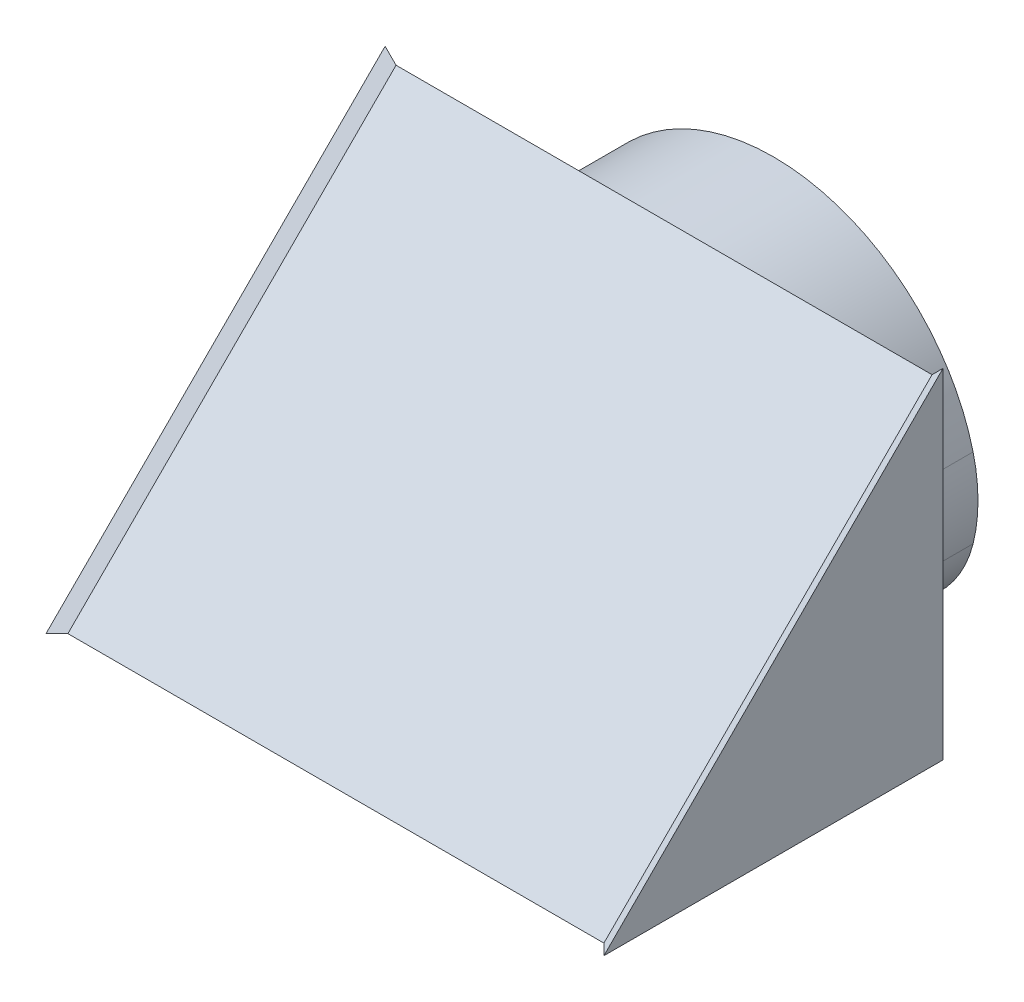
ISO-10303-21;
HEADER;
FILE_DESCRIPTION(('STEP AP214'),'2;1');
FILE_NAME('part.step','',(''),(''),'','','');
FILE_SCHEMA(('AUTOMOTIVE_DESIGN { 1 0 10303 214 1 1 1 1 }'));
ENDSEC;
DATA;
#1=APPLICATION_CONTEXT('core data for automotive mechanical design processes');
#2=APPLICATION_PROTOCOL_DEFINITION('international standard','automotive_design',2000,#1);
#3=PRODUCT_CONTEXT('',#1,'mechanical');
#4=PRODUCT('Part','Part','',(#3));
#5=PRODUCT_RELATED_PRODUCT_CATEGORY('part','',(#4));
#6=PRODUCT_DEFINITION_FORMATION('','',#4);
#7=PRODUCT_DEFINITION_CONTEXT('part definition',#1,'design');
#8=PRODUCT_DEFINITION('design','',#6,#7);
#9=PRODUCT_DEFINITION_SHAPE('','',#8);
#10=(LENGTH_UNIT() NAMED_UNIT(*) SI_UNIT(.MILLI.,.METRE.));
#11=(NAMED_UNIT(*) PLANE_ANGLE_UNIT() SI_UNIT($,.RADIAN.));
#12=(NAMED_UNIT(*) SI_UNIT($,.STERADIAN.) SOLID_ANGLE_UNIT());
#13=UNCERTAINTY_MEASURE_WITH_UNIT(LENGTH_MEASURE(1.E-05),#10,'distance_accuracy_value','');
#14=(GEOMETRIC_REPRESENTATION_CONTEXT(3) GLOBAL_UNCERTAINTY_ASSIGNED_CONTEXT((#13)) GLOBAL_UNIT_ASSIGNED_CONTEXT((#10,
#11,#12)) REPRESENTATION_CONTEXT('',''));
#15=CARTESIAN_POINT('',(0.,0.,0.));
#16=DIRECTION('',(0.,0.,1.));
#17=DIRECTION('',(1.,0.,0.));
#18=AXIS2_PLACEMENT_3D('',#15,#16,#17);
#19=CARTESIAN_POINT('',(10.2,12.,0.));
#20=DIRECTION('',(0.,0.,1.));
#21=DIRECTION('',(0.,-1.,0.));
#22=AXIS2_PLACEMENT_3D('',#19,#20,#21);
#23=PLANE('',#22);
#24=CARTESIAN_POINT('',(2.94796327024208,4.48690621016901,0.));
#25=DIRECTION('',(0.,0.,-1.));
#26=DIRECTION('',(0.,-1.,0.));
#27=AXIS2_PLACEMENT_3D('',#24,#25,#26);
#28=CIRCLE('',#27,4.48690621016901);
#29=CARTESIAN_POINT('',(7.30012051014887,3.39555168574525,0.));
#30=VERTEX_POINT('',#29);
#31=CARTESIAN_POINT('',(2.94796327024208,0.,0.));
#32=VERTEX_POINT('',#31);
#33=EDGE_CURVE('E61',#30,#32,#28,.T.);
#34=ORIENTED_EDGE('',*,*,#33,.F.);
#35=CARTESIAN_POINT('',(1.5,4.85,0.));
#36=DIRECTION('',(0.,0.,-1.));
#37=DIRECTION('',(0.,-1.,0.));
#38=AXIS2_PLACEMENT_3D('',#35,#36,#37);
#39=CIRCLE('',#38,5.97970048004815);
#40=CARTESIAN_POINT('',(7.30012051014887,6.30444831425474,0.));
#41=VERTEX_POINT('',#40);
#42=EDGE_CURVE('E65',#41,#30,#39,.T.);
#43=ORIENTED_EDGE('',*,*,#42,.F.);
#44=CARTESIAN_POINT('',(0.,4.47385738924481,0.));
#45=DIRECTION('',(0.,0.,-1.));
#46=DIRECTION('',(0.,-1.,0.));
#47=AXIS2_PLACEMENT_3D('',#44,#45,#46);
#48=CIRCLE('',#47,7.52614261075519);
#49=CARTESIAN_POINT('',(0.,12.,0.));
#50=VERTEX_POINT('',#49);
#51=EDGE_CURVE('E11',#50,#41,#48,.T.);
#52=ORIENTED_EDGE('',*,*,#51,.F.);
#53=DIRECTION('',(-1.,0.,0.));
#54=VECTOR('',#53,1.);
#55=CARTESIAN_POINT('',(10.2,12.,0.));
#56=LINE('',#55,#54);
#57=CARTESIAN_POINT('',(9.8,12.,0.));
#58=VERTEX_POINT('',#57);
#59=EDGE_CURVE('E47',#58,#50,#56,.T.);
#60=ORIENTED_EDGE('',*,*,#59,.F.);
#61=DIRECTION('',(0.707106781186547,0.707106781186547,0.));
#62=VECTOR('',#61,1.);
#63=CARTESIAN_POINT('',(9.8,12.,0.));
#64=LINE('',#63,#62);
#65=CARTESIAN_POINT('',(10.2,12.4,0.));
#66=VERTEX_POINT('',#65);
#67=EDGE_CURVE('E226',#58,#66,#64,.T.);
#68=ORIENTED_EDGE('',*,*,#67,.T.);
#69=DIRECTION('',(0.,1.,0.));
#70=VECTOR('',#69,1.);
#71=CARTESIAN_POINT('',(10.2,12.,0.));
#72=LINE('',#71,#70);
#73=CARTESIAN_POINT('',(10.2,0.,0.));
#74=VERTEX_POINT('',#73);
#75=EDGE_CURVE('E245',#74,#66,#72,.T.);
#76=ORIENTED_EDGE('',*,*,#75,.F.);
#77=DIRECTION('',(-1.,0.,0.));
#78=VECTOR('',#77,1.);
#79=CARTESIAN_POINT('',(10.2,0.,0.));
#80=LINE('',#79,#78);
#81=EDGE_CURVE('E258',#74,#32,#80,.T.);
#82=ORIENTED_EDGE('',*,*,#81,.T.);
#83=EDGE_LOOP('',(#34,#43,#52,#60,#68,#76,#82));
#84=FACE_BOUND('',#83,.T.);
#85=ADVANCED_FACE('F43',(#84),#23,.F.);
#86=CARTESIAN_POINT('',(-7.30012051014888,6.30444831425475,0.));
#87=VERTEX_POINT('',#86);
#88=EDGE_CURVE('E54',#87,#50,#48,.T.);
#89=ORIENTED_EDGE('',*,*,#88,.F.);
#90=CARTESIAN_POINT('',(-1.5,4.85,0.));
#91=DIRECTION('',(0.,0.,-1.));
#92=DIRECTION('',(0.,-1.,0.));
#93=AXIS2_PLACEMENT_3D('',#90,#91,#92);
#94=CIRCLE('',#93,5.97970048004816);
#95=CARTESIAN_POINT('',(-7.30012051014887,3.39555168574523,0.));
#96=VERTEX_POINT('',#95);
#97=EDGE_CURVE('E287',#96,#87,#94,.T.);
#98=ORIENTED_EDGE('',*,*,#97,.F.);
#99=CARTESIAN_POINT('',(-2.94796327024208,4.48690621016901,0.));
#100=DIRECTION('',(0.,0.,-1.));
#101=DIRECTION('',(0.,1.,0.));
#102=AXIS2_PLACEMENT_3D('',#99,#100,#101);
#103=CIRCLE('',#102,4.48690621016902);
#104=CARTESIAN_POINT('',(-2.94796327024208,0.,0.));
#105=VERTEX_POINT('',#104);
#106=EDGE_CURVE('E291',#105,#96,#103,.T.);
#107=ORIENTED_EDGE('',*,*,#106,.F.);
#108=CARTESIAN_POINT('',(-10.2,0.,0.));
#109=VERTEX_POINT('',#108);
#110=EDGE_CURVE('E252',#105,#109,#80,.T.);
#111=ORIENTED_EDGE('',*,*,#110,.T.);
#112=DIRECTION('',(0.,1.,0.));
#113=VECTOR('',#112,1.);
#114=CARTESIAN_POINT('',(-10.2,12.,0.));
#115=LINE('',#114,#113);
#116=CARTESIAN_POINT('',(-10.2,12.4,0.));
#117=VERTEX_POINT('',#116);
#118=EDGE_CURVE('E233',#109,#117,#115,.T.);
#119=ORIENTED_EDGE('',*,*,#118,.T.);
#120=DIRECTION('',(0.707106781186547,-0.707106781186547,0.));
#121=VECTOR('',#120,1.);
#122=CARTESIAN_POINT('',(-10.2,12.4,0.));
#123=LINE('',#122,#121);
#124=CARTESIAN_POINT('',(-9.8,12.,0.));
#125=VERTEX_POINT('',#124);
#126=EDGE_CURVE('E218',#117,#125,#123,.T.);
#127=ORIENTED_EDGE('',*,*,#126,.T.);
#128=EDGE_CURVE('E263',#50,#125,#56,.T.);
#129=ORIENTED_EDGE('',*,*,#128,.F.);
#130=EDGE_LOOP('',(#89,#98,#107,#111,#119,#127,#129));
#131=FACE_BOUND('',#130,.T.);
#132=ADVANCED_FACE('F45',(#131),#23,.F.);
#133=CARTESIAN_POINT('',(10.2,0.,12.0000000000001));
#134=DIRECTION('',(0.,-0.707106781186551,-0.707106781186544));
#135=DIRECTION('',(0.,0.707106781186544,-0.707106781186551));
#136=AXIS2_PLACEMENT_3D('',#133,#134,#135);
#137=PLANE('',#136);
#138=ORIENTED_EDGE('',*,*,#59,.T.);
#139=ORIENTED_EDGE('',*,*,#128,.T.);
#140=DIRECTION('',(0.,0.707106781186544,-0.707106781186551));
#141=VECTOR('',#140,1.);
#142=CARTESIAN_POINT('',(-9.8,-0.68284271247462,12.6828427124747));
#143=LINE('',#142,#141);
#144=CARTESIAN_POINT('',(-9.8,0.,12.0000000000001));
#145=VERTEX_POINT('',#144);
#146=EDGE_CURVE('E219',#145,#125,#143,.T.);
#147=ORIENTED_EDGE('',*,*,#146,.F.);
#148=DIRECTION('',(-1.,0.,0.));
#149=VECTOR('',#148,1.);
#150=CARTESIAN_POINT('',(10.2,0.,12.0000000000001));
#151=LINE('',#150,#149);
#152=CARTESIAN_POINT('',(9.8,0.,12.0000000000001));
#153=VERTEX_POINT('',#152);
#154=EDGE_CURVE('E260',#153,#145,#151,.T.);
#155=ORIENTED_EDGE('',*,*,#154,.F.);
#156=DIRECTION('',(0.,0.707106781186544,-0.707106781186551));
#157=VECTOR('',#156,1.);
#158=CARTESIAN_POINT('',(9.8,-0.68284271247462,12.6828427124747));
#159=LINE('',#158,#157);
#160=EDGE_CURVE('E238',#153,#58,#159,.T.);
#161=ORIENTED_EDGE('',*,*,#160,.T.);
#162=EDGE_LOOP('',(#138,#139,#147,#155,#161));
#163=FACE_BOUND('',#162,.T.);
#164=ADVANCED_FACE('F274',(#163),#137,.F.);
#165=CARTESIAN_POINT('',(10.2,0.,0.));
#166=DIRECTION('',(0.,1.,0.));
#167=DIRECTION('',(0.,0.,1.));
#168=AXIS2_PLACEMENT_3D('',#165,#166,#167);
#169=PLANE('',#168);
#170=DIRECTION('',(-1.,0.,0.));
#171=VECTOR('',#170,1.);
#172=CARTESIAN_POINT('',(0.,0.,1.8));
#173=LINE('',#172,#171);
#174=CARTESIAN_POINT('',(2.94796327024208,0.,1.8));
#175=VERTEX_POINT('',#174);
#176=CARTESIAN_POINT('',(-2.94796327024208,0.,1.8));
#177=VERTEX_POINT('',#176);
#178=EDGE_CURVE('E179',#175,#177,#173,.T.);
#179=ORIENTED_EDGE('',*,*,#178,.F.);
#180=DIRECTION('',(0.,0.,-1.));
#181=VECTOR('',#180,1.);
#182=CARTESIAN_POINT('',(2.94796327024208,0.,1.8));
#183=LINE('',#182,#181);
#184=EDGE_CURVE('E201',#175,#32,#183,.T.);
#185=ORIENTED_EDGE('',*,*,#184,.T.);
#186=ORIENTED_EDGE('',*,*,#81,.F.);
#187=DIRECTION('',(0.,0.,-1.));
#188=VECTOR('',#187,1.);
#189=CARTESIAN_POINT('',(10.2,0.,0.));
#190=LINE('',#189,#188);
#191=CARTESIAN_POINT('',(10.2,0.,12.4000000000001));
#192=VERTEX_POINT('',#191);
#193=EDGE_CURVE('E248',#192,#74,#190,.T.);
#194=ORIENTED_EDGE('',*,*,#193,.F.);
#195=DIRECTION('',(-0.707106781186544,0.,-0.707106781186551));
#196=VECTOR('',#195,1.);
#197=CARTESIAN_POINT('',(10.1414213562373,0.,12.3414213562374));
#198=LINE('',#197,#196);
#199=EDGE_CURVE('E230',#192,#153,#198,.T.);
#200=ORIENTED_EDGE('',*,*,#199,.T.);
#201=ORIENTED_EDGE('',*,*,#154,.T.);
#202=DIRECTION('',(-0.707106781186544,0.,0.707106781186551));
#203=VECTOR('',#202,1.);
#204=CARTESIAN_POINT('',(-10.3414213562373,0.,12.5414213562374));
#205=LINE('',#204,#203);
#206=CARTESIAN_POINT('',(-10.2,0.,12.4000000000001));
#207=VERTEX_POINT('',#206);
#208=EDGE_CURVE('E204',#145,#207,#205,.T.);
#209=ORIENTED_EDGE('',*,*,#208,.T.);
#210=DIRECTION('',(0.,0.,-1.));
#211=VECTOR('',#210,1.);
#212=CARTESIAN_POINT('',(-10.2,0.,0.));
#213=LINE('',#212,#211);
#214=EDGE_CURVE('E249',#207,#109,#213,.T.);
#215=ORIENTED_EDGE('',*,*,#214,.T.);
#216=ORIENTED_EDGE('',*,*,#110,.F.);
#217=DIRECTION('',(0.,0.,-1.));
#218=VECTOR('',#217,1.);
#219=CARTESIAN_POINT('',(-2.94796327024208,0.,1.8));
#220=LINE('',#219,#218);
#221=EDGE_CURVE('E208',#177,#105,#220,.T.);
#222=ORIENTED_EDGE('',*,*,#221,.F.);
#223=EDGE_LOOP('',(#179,#185,#186,#194,#200,#201,#209,#215,#216,#222));
#224=FACE_BOUND('',#223,.T.);
#225=ADVANCED_FACE('F363',(#224),#169,.F.);
#226=CARTESIAN_POINT('',(10.2,0.,0.));
#227=DIRECTION('',(-1.,0.,0.));
#228=DIRECTION('',(0.,0.,1.));
#229=AXIS2_PLACEMENT_3D('',#226,#227,#228);
#230=PLANE('',#229);
#231=ORIENTED_EDGE('',*,*,#75,.T.);
#232=DIRECTION('',(0.,0.707106781186544,-0.707106781186551));
#233=VECTOR('',#232,1.);
#234=CARTESIAN_POINT('',(10.2,-0.282842712474621,12.6828427124747));
#235=LINE('',#234,#233);
#236=EDGE_CURVE('E234',#192,#66,#235,.T.);
#237=ORIENTED_EDGE('',*,*,#236,.F.);
#238=ORIENTED_EDGE('',*,*,#193,.T.);
#239=EDGE_LOOP('',(#231,#237,#238));
#240=FACE_BOUND('',#239,.T.);
#241=ADVANCED_FACE('F367',(#240),#230,.F.);
#242=CARTESIAN_POINT('',(-10.2,0.,0.));
#243=DIRECTION('',(-1.,0.,0.));
#244=DIRECTION('',(0.,0.,1.));
#245=AXIS2_PLACEMENT_3D('',#242,#243,#244);
#246=PLANE('',#245);
#247=ORIENTED_EDGE('',*,*,#118,.F.);
#248=ORIENTED_EDGE('',*,*,#214,.F.);
#249=DIRECTION('',(0.,0.707106781186544,-0.707106781186551));
#250=VECTOR('',#249,1.);
#251=CARTESIAN_POINT('',(-10.2,-0.282842712474621,12.6828427124747));
#252=LINE('',#251,#250);
#253=EDGE_CURVE('E214',#207,#117,#252,.T.);
#254=ORIENTED_EDGE('',*,*,#253,.T.);
#255=EDGE_LOOP('',(#247,#248,#254));
#256=FACE_BOUND('',#255,.T.);
#257=ADVANCED_FACE('F370',(#256),#246,.T.);
#258=CARTESIAN_POINT('',(9.8,-0.68284271247462,12.6828427124747));
#259=DIRECTION('',(-0.577350269189628,0.577350269189628,0.577350269189622));
#260=DIRECTION('',(-0.707106781186548,-0.707106781186547,0.));
#261=AXIS2_PLACEMENT_3D('',#258,#259,#260);
#262=PLANE('',#261);
#263=ORIENTED_EDGE('',*,*,#199,.F.);
#264=ORIENTED_EDGE('',*,*,#236,.T.);
#265=ORIENTED_EDGE('',*,*,#67,.F.);
#266=ORIENTED_EDGE('',*,*,#160,.F.);
#267=EDGE_LOOP('',(#263,#264,#265,#266));
#268=FACE_BOUND('',#267,.T.);
#269=ADVANCED_FACE('F373',(#268),#262,.T.);
#270=CARTESIAN_POINT('',(-10.2,-0.282842712474621,12.6828427124747));
#271=DIRECTION('',(0.577350269189628,0.577350269189628,0.577350269189622));
#272=DIRECTION('',(-0.707106781186548,0.707106781186547,0.));
#273=AXIS2_PLACEMENT_3D('',#270,#271,#272);
#274=PLANE('',#273);
#275=ORIENTED_EDGE('',*,*,#208,.F.);
#276=ORIENTED_EDGE('',*,*,#146,.T.);
#277=ORIENTED_EDGE('',*,*,#126,.F.);
#278=ORIENTED_EDGE('',*,*,#253,.F.);
#279=EDGE_LOOP('',(#275,#276,#277,#278));
#280=FACE_BOUND('',#279,.T.);
#281=ADVANCED_FACE('F380',(#280),#274,.T.);
#282=CARTESIAN_POINT('',(2.94796327024208,0.447963270242083,1.8));
#283=DIRECTION('',(0.,0.,-1.));
#284=DIRECTION('',(0.,1.,0.));
#285=AXIS2_PLACEMENT_3D('',#282,#283,#284);
#286=CYLINDRICAL_SURFACE('',#285,0.447963270242082);
#287=DIRECTION('',(0.,0.,-1.));
#288=VECTOR('',#287,1.);
#289=CARTESIAN_POINT('',(2.69870158235748,0.820172488879797,1.8));
#290=LINE('',#289,#288);
#291=CARTESIAN_POINT('',(2.69870158235748,0.820172488879797,1.8));
#292=VERTEX_POINT('',#291);
#293=CARTESIAN_POINT('',(2.69870158235748,0.820172488879795,-4.));
#294=VERTEX_POINT('',#293);
#295=EDGE_CURVE('E155',#292,#294,#290,.T.);
#296=ORIENTED_EDGE('',*,*,#295,.T.);
#297=CARTESIAN_POINT('',(2.94796327024208,0.447963270242081,-4.));
#298=DIRECTION('',(0.,0.,-1.));
#299=DIRECTION('',(0.,1.,0.));
#300=AXIS2_PLACEMENT_3D('',#297,#298,#299);
#301=CIRCLE('',#300,0.447963270242082);
#302=CARTESIAN_POINT('',(2.94796327024208,0.,-4.));
#303=VERTEX_POINT('',#302);
#304=EDGE_CURVE('E148',#303,#294,#301,.T.);
#305=ORIENTED_EDGE('',*,*,#304,.F.);
#306=DIRECTION('',(0.,0.,1.));
#307=VECTOR('',#306,1.);
#308=CARTESIAN_POINT('',(2.94796327024208,0.,-4.));
#309=LINE('',#308,#307);
#310=EDGE_CURVE('E153',#303,#32,#309,.T.);
#311=ORIENTED_EDGE('',*,*,#310,.T.);
#312=ORIENTED_EDGE('',*,*,#184,.F.);
#313=CARTESIAN_POINT('',(2.94796327024208,0.447963270242083,1.8));
#314=DIRECTION('',(0.,0.,-1.));
#315=DIRECTION('',(0.,1.,0.));
#316=AXIS2_PLACEMENT_3D('',#313,#314,#315);
#317=CIRCLE('',#316,0.447963270242082);
#318=EDGE_CURVE('E174',#175,#292,#317,.T.);
#319=ORIENTED_EDGE('',*,*,#318,.T.);
#320=EDGE_LOOP('',(#296,#305,#311,#312,#319));
#321=FACE_BOUND('',#320,.T.);
#322=ADVANCED_FACE('F150',(#321),#286,.T.);
#323=CARTESIAN_POINT('',(0.,4.85,1.8));
#324=DIRECTION('',(0.,0.,-1.));
#325=DIRECTION('',(0.,1.,0.));
#326=AXIS2_PLACEMENT_3D('',#323,#324,#325);
#327=CYLINDRICAL_SURFACE('',#326,4.85);
#328=DIRECTION('',(0.,0.,-1.));
#329=VECTOR('',#328,1.);
#330=CARTESIAN_POINT('',(-2.69870158235748,0.820172488879797,1.8));
#331=LINE('',#330,#329);
#332=CARTESIAN_POINT('',(-2.69870158235748,0.820172488879797,1.8));
#333=VERTEX_POINT('',#332);
#334=CARTESIAN_POINT('',(-2.69870158235748,0.820172488879794,-4.));
#335=VERTEX_POINT('',#334);
#336=EDGE_CURVE('E205',#333,#335,#331,.T.);
#337=ORIENTED_EDGE('',*,*,#336,.T.);
#338=CARTESIAN_POINT('',(0.,4.85,-4.));
#339=DIRECTION('',(0.,0.,1.));
#340=DIRECTION('',(0.,1.,0.));
#341=AXIS2_PLACEMENT_3D('',#338,#339,#340);
#342=CIRCLE('',#341,4.85);
#343=EDGE_CURVE('E160',#294,#335,#342,.T.);
#344=ORIENTED_EDGE('',*,*,#343,.F.);
#345=ORIENTED_EDGE('',*,*,#295,.F.);
#346=CARTESIAN_POINT('',(0.,4.85,1.8));
#347=DIRECTION('',(0.,0.,-1.));
#348=DIRECTION('',(0.,1.,0.));
#349=AXIS2_PLACEMENT_3D('',#346,#347,#348);
#350=CIRCLE('',#349,4.85);
#351=EDGE_CURVE('E193',#333,#292,#350,.T.);
#352=ORIENTED_EDGE('',*,*,#351,.F.);
#353=EDGE_LOOP('',(#337,#344,#345,#352));
#354=FACE_BOUND('',#353,.T.);
#355=ADVANCED_FACE('F352',(#354),#327,.F.);
#356=CARTESIAN_POINT('',(-2.94796327024208,0.447963270242083,1.8));
#357=DIRECTION('',(0.,0.,-1.));
#358=DIRECTION('',(0.,1.,0.));
#359=AXIS2_PLACEMENT_3D('',#356,#357,#358);
#360=CYLINDRICAL_SURFACE('',#359,0.447963270242082);
#361=ORIENTED_EDGE('',*,*,#221,.T.);
#362=DIRECTION('',(0.,0.,1.));
#363=VECTOR('',#362,1.);
#364=CARTESIAN_POINT('',(-2.94796327024208,0.,-4.));
#365=LINE('',#364,#363);
#366=CARTESIAN_POINT('',(-2.94796327024208,0.,-4.));
#367=VERTEX_POINT('',#366);
#368=EDGE_CURVE('E175',#367,#105,#365,.T.);
#369=ORIENTED_EDGE('',*,*,#368,.F.);
#370=CARTESIAN_POINT('',(-2.94796327024208,0.447963270242081,-4.));
#371=DIRECTION('',(0.,0.,-1.));
#372=DIRECTION('',(0.,1.,0.));
#373=AXIS2_PLACEMENT_3D('',#370,#371,#372);
#374=CIRCLE('',#373,0.447963270242082);
#375=EDGE_CURVE('E329',#335,#367,#374,.T.);
#376=ORIENTED_EDGE('',*,*,#375,.F.);
#377=ORIENTED_EDGE('',*,*,#336,.F.);
#378=CARTESIAN_POINT('',(-2.94796327024208,0.447963270242083,1.8));
#379=DIRECTION('',(0.,0.,-1.));
#380=DIRECTION('',(0.,1.,0.));
#381=AXIS2_PLACEMENT_3D('',#378,#379,#380);
#382=CIRCLE('',#381,0.447963270242082);
#383=EDGE_CURVE('E189',#177,#333,#382,.F.);
#384=ORIENTED_EDGE('',*,*,#383,.F.);
#385=EDGE_LOOP('',(#361,#369,#376,#377,#384));
#386=FACE_BOUND('',#385,.T.);
#387=ADVANCED_FACE('F343',(#386),#360,.T.);
#388=CARTESIAN_POINT('',(0.,4.85,1.8));
#389=DIRECTION('',(0.,0.,-1.));
#390=DIRECTION('',(0.,1.,0.));
#391=AXIS2_PLACEMENT_3D('',#388,#389,#390);
#392=CYLINDRICAL_SURFACE('',#391,3.65);
#393=CARTESIAN_POINT('',(0.,4.85,1.8));
#394=DIRECTION('',(0.,0.,-1.));
#395=DIRECTION('',(0.,1.,0.));
#396=AXIS2_PLACEMENT_3D('',#393,#394,#395);
#397=CIRCLE('',#396,3.65);
#398=CARTESIAN_POINT('',(0.,8.5,1.8));
#399=VERTEX_POINT('',#398);
#400=EDGE_CURVE('E197',#399,#399,#397,.T.);
#401=ORIENTED_EDGE('',*,*,#400,.T.);
#402=EDGE_LOOP('',(#401));
#403=FACE_BOUND('',#402,.T.);
#404=CARTESIAN_POINT('',(0.,4.85,-4.));
#405=DIRECTION('',(0.,0.,-1.));
#406=DIRECTION('',(0.,1.,0.));
#407=AXIS2_PLACEMENT_3D('',#404,#405,#406);
#408=CIRCLE('',#407,3.65);
#409=CARTESIAN_POINT('',(0.,8.5,-4.));
#410=VERTEX_POINT('',#409);
#411=EDGE_CURVE('E317',#410,#410,#408,.T.);
#412=ORIENTED_EDGE('',*,*,#411,.F.);
#413=EDGE_LOOP('',(#412));
#414=FACE_BOUND('',#413,.T.);
#415=ADVANCED_FACE('F340',(#403,#414),#392,.T.);
#416=CARTESIAN_POINT('',(0.,0.,1.8));
#417=DIRECTION('',(0.,0.,-1.));
#418=DIRECTION('',(0.,1.,0.));
#419=AXIS2_PLACEMENT_3D('',#416,#417,#418);
#420=PLANE('',#419);
#421=ORIENTED_EDGE('',*,*,#318,.F.);
#422=ORIENTED_EDGE('',*,*,#178,.T.);
#423=ORIENTED_EDGE('',*,*,#383,.T.);
#424=ORIENTED_EDGE('',*,*,#351,.T.);
#425=EDGE_LOOP('',(#421,#422,#423,#424));
#426=FACE_BOUND('',#425,.T.);
#427=ORIENTED_EDGE('',*,*,#400,.F.);
#428=EDGE_LOOP('',(#427));
#429=FACE_BOUND('',#428,.T.);
#430=ADVANCED_FACE('F342',(#426,#429),#420,.T.);
#431=CARTESIAN_POINT('',(2.94796327024208,4.48690621016901,-4.));
#432=DIRECTION('',(0.,0.,1.));
#433=DIRECTION('',(0.,-1.,0.));
#434=AXIS2_PLACEMENT_3D('',#431,#432,#433);
#435=CYLINDRICAL_SURFACE('',#434,4.48690621016901);
#436=ORIENTED_EDGE('',*,*,#33,.T.);
#437=ORIENTED_EDGE('',*,*,#310,.F.);
#438=CARTESIAN_POINT('',(2.94796327024208,4.48690621016901,-4.));
#439=DIRECTION('',(0.,0.,-1.));
#440=DIRECTION('',(0.,-1.,0.));
#441=AXIS2_PLACEMENT_3D('',#438,#439,#440);
#442=CIRCLE('',#441,4.48690621016901);
#443=CARTESIAN_POINT('',(7.30012051014887,3.39555168574525,-4.));
#444=VERTEX_POINT('',#443);
#445=EDGE_CURVE('E161',#444,#303,#442,.T.);
#446=ORIENTED_EDGE('',*,*,#445,.F.);
#447=DIRECTION('',(0.,0.,1.));
#448=VECTOR('',#447,1.);
#449=CARTESIAN_POINT('',(7.30012051014887,3.39555168574525,-4.));
#450=LINE('',#449,#448);
#451=EDGE_CURVE('E295',#444,#30,#450,.T.);
#452=ORIENTED_EDGE('',*,*,#451,.T.);
#453=EDGE_LOOP('',(#436,#437,#446,#452));
#454=FACE_BOUND('',#453,.T.);
#455=ADVANCED_FACE('F172',(#454),#435,.T.);
#456=CARTESIAN_POINT('',(-2.94796327024208,4.48690621016901,-4.));
#457=DIRECTION('',(0.,0.,1.));
#458=DIRECTION('',(0.,-1.,0.));
#459=AXIS2_PLACEMENT_3D('',#456,#457,#458);
#460=CYLINDRICAL_SURFACE('',#459,4.48690621016902);
#461=ORIENTED_EDGE('',*,*,#106,.T.);
#462=DIRECTION('',(0.,0.,1.));
#463=VECTOR('',#462,1.);
#464=CARTESIAN_POINT('',(-7.30012051014887,3.39555168574523,-4.));
#465=LINE('',#464,#463);
#466=CARTESIAN_POINT('',(-7.30012051014887,3.39555168574523,-4.));
#467=VERTEX_POINT('',#466);
#468=EDGE_CURVE('E182',#467,#96,#465,.T.);
#469=ORIENTED_EDGE('',*,*,#468,.F.);
#470=CARTESIAN_POINT('',(-2.94796327024208,4.48690621016901,-4.));
#471=DIRECTION('',(0.,0.,-1.));
#472=DIRECTION('',(0.,1.,0.));
#473=AXIS2_PLACEMENT_3D('',#470,#471,#472);
#474=CIRCLE('',#473,4.48690621016902);
#475=EDGE_CURVE('E313',#367,#467,#474,.T.);
#476=ORIENTED_EDGE('',*,*,#475,.F.);
#477=ORIENTED_EDGE('',*,*,#368,.T.);
#478=EDGE_LOOP('',(#461,#469,#476,#477));
#479=FACE_BOUND('',#478,.T.);
#480=ADVANCED_FACE('F312',(#479),#460,.T.);
#481=CARTESIAN_POINT('',(-1.5,4.85,-4.));
#482=DIRECTION('',(0.,0.,1.));
#483=DIRECTION('',(0.,-1.,0.));
#484=AXIS2_PLACEMENT_3D('',#481,#482,#483);
#485=CYLINDRICAL_SURFACE('',#484,5.97970048004816);
#486=ORIENTED_EDGE('',*,*,#97,.T.);
#487=DIRECTION('',(0.,0.,1.));
#488=VECTOR('',#487,1.);
#489=CARTESIAN_POINT('',(-7.30012051014888,6.30444831425475,-4.));
#490=LINE('',#489,#488);
#491=CARTESIAN_POINT('',(-7.30012051014888,6.30444831425475,-4.));
#492=VERTEX_POINT('',#491);
#493=EDGE_CURVE('E283',#492,#87,#490,.T.);
#494=ORIENTED_EDGE('',*,*,#493,.F.);
#495=CARTESIAN_POINT('',(-1.5,4.85,-4.));
#496=DIRECTION('',(0.,0.,-1.));
#497=DIRECTION('',(0.,-1.,0.));
#498=AXIS2_PLACEMENT_3D('',#495,#496,#497);
#499=CIRCLE('',#498,5.97970048004816);
#500=EDGE_CURVE('E308',#467,#492,#499,.T.);
#501=ORIENTED_EDGE('',*,*,#500,.F.);
#502=ORIENTED_EDGE('',*,*,#468,.T.);
#503=EDGE_LOOP('',(#486,#494,#501,#502));
#504=FACE_BOUND('',#503,.T.);
#505=ADVANCED_FACE('F307',(#504),#485,.T.);
#506=CARTESIAN_POINT('',(0.,4.47385738924481,-4.));
#507=DIRECTION('',(0.,0.,1.));
#508=DIRECTION('',(0.,-1.,0.));
#509=AXIS2_PLACEMENT_3D('',#506,#507,#508);
#510=CYLINDRICAL_SURFACE('',#509,7.52614261075519);
#511=ORIENTED_EDGE('',*,*,#88,.T.);
#512=ORIENTED_EDGE('',*,*,#51,.T.);
#513=DIRECTION('',(0.,0.,1.));
#514=VECTOR('',#513,1.);
#515=CARTESIAN_POINT('',(7.30012051014887,6.30444831425474,-4.));
#516=LINE('',#515,#514);
#517=CARTESIAN_POINT('',(7.30012051014887,6.30444831425474,-4.));
#518=VERTEX_POINT('',#517);
#519=EDGE_CURVE('E298',#518,#41,#516,.T.);
#520=ORIENTED_EDGE('',*,*,#519,.F.);
#521=CARTESIAN_POINT('',(0.,4.47385738924481,-4.));
#522=DIRECTION('',(0.,0.,-1.));
#523=DIRECTION('',(0.,-1.,0.));
#524=AXIS2_PLACEMENT_3D('',#521,#522,#523);
#525=CIRCLE('',#524,7.52614261075519);
#526=EDGE_CURVE('E322',#492,#518,#525,.T.);
#527=ORIENTED_EDGE('',*,*,#526,.F.);
#528=ORIENTED_EDGE('',*,*,#493,.T.);
#529=EDGE_LOOP('',(#511,#512,#520,#527,#528));
#530=FACE_BOUND('',#529,.T.);
#531=ADVANCED_FACE('F278',(#530),#510,.T.);
#532=CARTESIAN_POINT('',(1.5,4.85,-4.));
#533=DIRECTION('',(0.,0.,1.));
#534=DIRECTION('',(0.,-1.,0.));
#535=AXIS2_PLACEMENT_3D('',#532,#533,#534);
#536=CYLINDRICAL_SURFACE('',#535,5.97970048004815);
#537=ORIENTED_EDGE('',*,*,#42,.T.);
#538=ORIENTED_EDGE('',*,*,#451,.F.);
#539=CARTESIAN_POINT('',(1.5,4.85,-4.));
#540=DIRECTION('',(0.,0.,-1.));
#541=DIRECTION('',(0.,-1.,0.));
#542=AXIS2_PLACEMENT_3D('',#539,#540,#541);
#543=CIRCLE('',#542,5.97970048004815);
#544=EDGE_CURVE('E166',#518,#444,#543,.T.);
#545=ORIENTED_EDGE('',*,*,#544,.F.);
#546=ORIENTED_EDGE('',*,*,#519,.T.);
#547=EDGE_LOOP('',(#537,#538,#545,#546));
#548=FACE_BOUND('',#547,.T.);
#549=ADVANCED_FACE('F406',(#548),#536,.T.);
#550=CARTESIAN_POINT('',(2.22398163512104,4.66845310508451,-4.));
#551=DIRECTION('',(0.,0.,1.));
#552=DIRECTION('',(0.,-1.,0.));
#553=AXIS2_PLACEMENT_3D('',#550,#551,#552);
#554=PLANE('',#553);
#555=ORIENTED_EDGE('',*,*,#445,.T.);
#556=ORIENTED_EDGE('',*,*,#304,.T.);
#557=ORIENTED_EDGE('',*,*,#343,.T.);
#558=ORIENTED_EDGE('',*,*,#375,.T.);
#559=ORIENTED_EDGE('',*,*,#475,.T.);
#560=ORIENTED_EDGE('',*,*,#500,.T.);
#561=ORIENTED_EDGE('',*,*,#526,.T.);
#562=ORIENTED_EDGE('',*,*,#544,.T.);
#563=EDGE_LOOP('',(#555,#556,#557,#558,#559,#560,#561,#562));
#564=FACE_BOUND('',#563,.T.);
#565=ADVANCED_FACE('F164',(#564),#554,.F.);
#566=CARTESIAN_POINT('',(0.,4.85,-4.));
#567=DIRECTION('',(0.,0.,-1.));
#568=DIRECTION('',(0.,1.,0.));
#569=AXIS2_PLACEMENT_3D('',#566,#567,#568);
#570=PLANE('',#569);
#571=ORIENTED_EDGE('',*,*,#411,.T.);
#572=EDGE_LOOP('',(#571));
#573=FACE_BOUND('',#572,.T.);
#574=ADVANCED_FACE('F338',(#573),#570,.T.);
#575=CLOSED_SHELL('',(#85,#132,#164,#225,#241,#257,#269,#281,#322,#355,#387,#415,#430,#455,#480,
#505,#531,#549,#565,#574));
#576=MANIFOLD_SOLID_BREP('B2',#575);
#577=ADVANCED_BREP_SHAPE_REPRESENTATION('',(#18,#576),#14);
#578=SHAPE_DEFINITION_REPRESENTATION(#9,#577);
ENDSEC;
END-ISO-10303-21;
